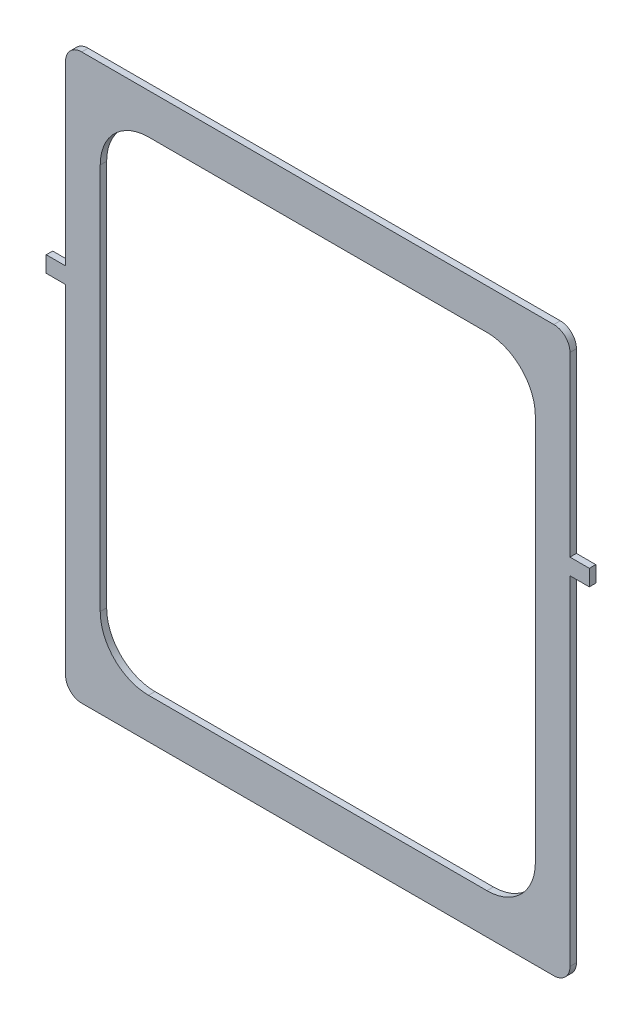
ISO-10303-21;
HEADER;
FILE_DESCRIPTION(('STEP AP214'),'2;1');
FILE_NAME('part.step','',(''),(''),'','','');
FILE_SCHEMA(('AUTOMOTIVE_DESIGN { 1 0 10303 214 1 1 1 1 }'));
ENDSEC;
DATA;
#1=APPLICATION_CONTEXT('core data for automotive mechanical design processes');
#2=APPLICATION_PROTOCOL_DEFINITION('international standard','automotive_design',2000,#1);
#3=PRODUCT_CONTEXT('',#1,'mechanical');
#4=PRODUCT('Part','Part','',(#3));
#5=PRODUCT_RELATED_PRODUCT_CATEGORY('part','',(#4));
#6=PRODUCT_DEFINITION_FORMATION('','',#4);
#7=PRODUCT_DEFINITION_CONTEXT('part definition',#1,'design');
#8=PRODUCT_DEFINITION('design','',#6,#7);
#9=PRODUCT_DEFINITION_SHAPE('','',#8);
#10=(LENGTH_UNIT() NAMED_UNIT(*) SI_UNIT(.MILLI.,.METRE.));
#11=(NAMED_UNIT(*) PLANE_ANGLE_UNIT() SI_UNIT($,.RADIAN.));
#12=(NAMED_UNIT(*) SI_UNIT($,.STERADIAN.) SOLID_ANGLE_UNIT());
#13=UNCERTAINTY_MEASURE_WITH_UNIT(LENGTH_MEASURE(1.E-05),#10,'distance_accuracy_value','');
#14=(GEOMETRIC_REPRESENTATION_CONTEXT(3) GLOBAL_UNCERTAINTY_ASSIGNED_CONTEXT((#13)) GLOBAL_UNIT_ASSIGNED_CONTEXT((#10,
#11,#12)) REPRESENTATION_CONTEXT('',''));
#15=CARTESIAN_POINT('',(0.,0.,0.));
#16=DIRECTION('',(0.,0.,1.));
#17=DIRECTION('',(1.,0.,0.));
#18=AXIS2_PLACEMENT_3D('',#15,#16,#17);
#19=CARTESIAN_POINT('',(-168.5,55.,0.));
#20=DIRECTION('',(-1.,0.,0.));
#21=DIRECTION('',(0.,-1.,0.));
#22=AXIS2_PLACEMENT_3D('',#19,#20,#21);
#23=PLANE('',#22);
#24=DIRECTION('',(0.,0.,1.));
#25=VECTOR('',#24,1.);
#26=CARTESIAN_POINT('',(-168.5,55.,0.));
#27=LINE('',#26,#25);
#28=CARTESIAN_POINT('',(-168.5,55.,-4.));
#29=VERTEX_POINT('',#28);
#30=CARTESIAN_POINT('',(-168.5,55.,0.));
#31=VERTEX_POINT('',#30);
#32=EDGE_CURVE('E12',#29,#31,#27,.T.);
#33=ORIENTED_EDGE('',*,*,#32,.F.);
#34=DIRECTION('',(0.,1.,0.));
#35=VECTOR('',#34,1.);
#36=CARTESIAN_POINT('',(-168.5,0.,-4.));
#37=LINE('',#36,#35);
#38=CARTESIAN_POINT('',(-168.5,45.,-4.));
#39=VERTEX_POINT('',#38);
#40=EDGE_CURVE('E163',#29,#39,#37,.F.);
#41=ORIENTED_EDGE('',*,*,#40,.T.);
#42=DIRECTION('',(0.,0.,1.));
#43=VECTOR('',#42,1.);
#44=CARTESIAN_POINT('',(-168.5,45.,0.));
#45=LINE('',#44,#43);
#46=CARTESIAN_POINT('',(-168.5,45.,0.));
#47=VERTEX_POINT('',#46);
#48=EDGE_CURVE('E56',#39,#47,#45,.T.);
#49=ORIENTED_EDGE('',*,*,#48,.T.);
#50=DIRECTION('',(0.,-1.,0.));
#51=VECTOR('',#50,1.);
#52=CARTESIAN_POINT('',(-168.5,55.,0.));
#53=LINE('',#52,#51);
#54=EDGE_CURVE('E333',#31,#47,#53,.T.);
#55=ORIENTED_EDGE('',*,*,#54,.F.);
#56=EDGE_LOOP('',(#33,#41,#49,#55));
#57=FACE_BOUND('',#56,.T.);
#58=ADVANCED_FACE('F45',(#57),#23,.T.);
#59=CARTESIAN_POINT('',(-168.5,45.,0.));
#60=DIRECTION('',(0.,-1.,0.));
#61=DIRECTION('',(1.,0.,0.));
#62=AXIS2_PLACEMENT_3D('',#59,#60,#61);
#63=PLANE('',#62);
#64=ORIENTED_EDGE('',*,*,#48,.F.);
#65=DIRECTION('',(1.,0.,0.));
#66=VECTOR('',#65,1.);
#67=CARTESIAN_POINT('',(0.,45.,-4.));
#68=LINE('',#67,#66);
#69=CARTESIAN_POINT('',(-156.5,45.,-4.));
#70=VERTEX_POINT('',#69);
#71=EDGE_CURVE('E239',#39,#70,#68,.T.);
#72=ORIENTED_EDGE('',*,*,#71,.T.);
#73=DIRECTION('',(0.,0.,1.));
#74=VECTOR('',#73,1.);
#75=CARTESIAN_POINT('',(-156.5,45.,0.));
#76=LINE('',#75,#74);
#77=CARTESIAN_POINT('',(-156.5,45.,0.));
#78=VERTEX_POINT('',#77);
#79=EDGE_CURVE('E323',#70,#78,#76,.T.);
#80=ORIENTED_EDGE('',*,*,#79,.T.);
#81=DIRECTION('',(1.,0.,0.));
#82=VECTOR('',#81,1.);
#83=CARTESIAN_POINT('',(-168.5,45.,0.));
#84=LINE('',#83,#82);
#85=EDGE_CURVE('E342',#47,#78,#84,.T.);
#86=ORIENTED_EDGE('',*,*,#85,.F.);
#87=EDGE_LOOP('',(#64,#72,#80,#86));
#88=FACE_BOUND('',#87,.T.);
#89=ADVANCED_FACE('F346',(#88),#63,.T.);
#90=CARTESIAN_POINT('',(-156.5,-175.,0.));
#91=DIRECTION('',(-1.,0.,0.));
#92=DIRECTION('',(0.,-1.,0.));
#93=AXIS2_PLACEMENT_3D('',#90,#91,#92);
#94=PLANE('',#93);
#95=ORIENTED_EDGE('',*,*,#79,.F.);
#96=DIRECTION('',(0.,1.,0.));
#97=VECTOR('',#96,1.);
#98=CARTESIAN_POINT('',(-156.5,0.,-4.));
#99=LINE('',#98,#97);
#100=CARTESIAN_POINT('',(-156.5,-165.,-4.));
#101=VERTEX_POINT('',#100);
#102=EDGE_CURVE('E236',#70,#101,#99,.F.);
#103=ORIENTED_EDGE('',*,*,#102,.T.);
#104=DIRECTION('',(0.,0.,1.));
#105=VECTOR('',#104,1.);
#106=CARTESIAN_POINT('',(-156.5,-165.,0.));
#107=LINE('',#106,#105);
#108=CARTESIAN_POINT('',(-156.5,-165.,0.));
#109=VERTEX_POINT('',#108);
#110=EDGE_CURVE('E319',#101,#109,#107,.T.);
#111=ORIENTED_EDGE('',*,*,#110,.T.);
#112=DIRECTION('',(0.,-1.,0.));
#113=VECTOR('',#112,1.);
#114=CARTESIAN_POINT('',(-156.5,-175.,0.));
#115=LINE('',#114,#113);
#116=EDGE_CURVE('E348',#78,#109,#115,.T.);
#117=ORIENTED_EDGE('',*,*,#116,.F.);
#118=EDGE_LOOP('',(#95,#103,#111,#117));
#119=FACE_BOUND('',#118,.T.);
#120=ADVANCED_FACE('F573',(#119),#94,.T.);
#121=CARTESIAN_POINT('',(-146.5,-165.,0.));
#122=DIRECTION('',(0.,0.,1.));
#123=DIRECTION('',(1.,0.,0.));
#124=AXIS2_PLACEMENT_3D('',#121,#122,#123);
#125=CYLINDRICAL_SURFACE('',#124,10.);
#126=ORIENTED_EDGE('',*,*,#110,.F.);
#127=CARTESIAN_POINT('',(-146.5,-165.,-4.));
#128=DIRECTION('',(0.,0.,1.));
#129=DIRECTION('',(1.,0.,0.));
#130=AXIS2_PLACEMENT_3D('',#127,#128,#129);
#131=CIRCLE('',#130,10.);
#132=CARTESIAN_POINT('',(-146.5,-175.,-4.));
#133=VERTEX_POINT('',#132);
#134=EDGE_CURVE('E231',#101,#133,#131,.T.);
#135=ORIENTED_EDGE('',*,*,#134,.T.);
#136=DIRECTION('',(0.,0.,1.));
#137=VECTOR('',#136,1.);
#138=CARTESIAN_POINT('',(-146.5,-175.,0.));
#139=LINE('',#138,#137);
#140=CARTESIAN_POINT('',(-146.5,-175.,0.));
#141=VERTEX_POINT('',#140);
#142=EDGE_CURVE('E315',#133,#141,#139,.T.);
#143=ORIENTED_EDGE('',*,*,#142,.T.);
#144=CARTESIAN_POINT('',(-146.5,-165.,0.));
#145=DIRECTION('',(0.,0.,1.));
#146=DIRECTION('',(1.,0.,0.));
#147=AXIS2_PLACEMENT_3D('',#144,#145,#146);
#148=CIRCLE('',#147,10.);
#149=EDGE_CURVE('E352',#109,#141,#148,.T.);
#150=ORIENTED_EDGE('',*,*,#149,.F.);
#151=EDGE_LOOP('',(#126,#135,#143,#150));
#152=FACE_BOUND('',#151,.T.);
#153=ADVANCED_FACE('F571',(#152),#125,.T.);
#154=CARTESIAN_POINT('',(156.5,-175.,0.));
#155=DIRECTION('',(0.,-1.,0.));
#156=DIRECTION('',(1.,0.,0.));
#157=AXIS2_PLACEMENT_3D('',#154,#155,#156);
#158=PLANE('',#157);
#159=ORIENTED_EDGE('',*,*,#142,.F.);
#160=DIRECTION('',(1.,0.,0.));
#161=VECTOR('',#160,1.);
#162=CARTESIAN_POINT('',(0.,-175.,-4.));
#163=LINE('',#162,#161);
#164=CARTESIAN_POINT('',(146.5,-175.,-4.));
#165=VERTEX_POINT('',#164);
#166=EDGE_CURVE('E226',#133,#165,#163,.T.);
#167=ORIENTED_EDGE('',*,*,#166,.T.);
#168=DIRECTION('',(0.,0.,1.));
#169=VECTOR('',#168,1.);
#170=CARTESIAN_POINT('',(146.5,-175.,0.));
#171=LINE('',#170,#169);
#172=CARTESIAN_POINT('',(146.5,-175.,0.));
#173=VERTEX_POINT('',#172);
#174=EDGE_CURVE('E311',#165,#173,#171,.T.);
#175=ORIENTED_EDGE('',*,*,#174,.T.);
#176=DIRECTION('',(1.,0.,0.));
#177=VECTOR('',#176,1.);
#178=CARTESIAN_POINT('',(156.5,-175.,0.));
#179=LINE('',#178,#177);
#180=EDGE_CURVE('E360',#141,#173,#179,.T.);
#181=ORIENTED_EDGE('',*,*,#180,.F.);
#182=EDGE_LOOP('',(#159,#167,#175,#181));
#183=FACE_BOUND('',#182,.T.);
#184=ADVANCED_FACE('F566',(#183),#158,.T.);
#185=CARTESIAN_POINT('',(146.5,-165.,0.));
#186=DIRECTION('',(0.,0.,1.));
#187=DIRECTION('',(1.,0.,0.));
#188=AXIS2_PLACEMENT_3D('',#185,#186,#187);
#189=CYLINDRICAL_SURFACE('',#188,10.);
#190=ORIENTED_EDGE('',*,*,#174,.F.);
#191=CARTESIAN_POINT('',(146.5,-165.,-4.));
#192=DIRECTION('',(0.,0.,1.));
#193=DIRECTION('',(1.,0.,0.));
#194=AXIS2_PLACEMENT_3D('',#191,#192,#193);
#195=CIRCLE('',#194,10.);
#196=CARTESIAN_POINT('',(156.5,-165.,-4.));
#197=VERTEX_POINT('',#196);
#198=EDGE_CURVE('E221',#165,#197,#195,.T.);
#199=ORIENTED_EDGE('',*,*,#198,.T.);
#200=DIRECTION('',(0.,0.,1.));
#201=VECTOR('',#200,1.);
#202=CARTESIAN_POINT('',(156.5,-165.,0.));
#203=LINE('',#202,#201);
#204=CARTESIAN_POINT('',(156.5,-165.,0.));
#205=VERTEX_POINT('',#204);
#206=EDGE_CURVE('E307',#197,#205,#203,.T.);
#207=ORIENTED_EDGE('',*,*,#206,.T.);
#208=CARTESIAN_POINT('',(146.5,-165.,0.));
#209=DIRECTION('',(0.,0.,1.));
#210=DIRECTION('',(1.,0.,0.));
#211=AXIS2_PLACEMENT_3D('',#208,#209,#210);
#212=CIRCLE('',#211,10.);
#213=EDGE_CURVE('E364',#173,#205,#212,.T.);
#214=ORIENTED_EDGE('',*,*,#213,.F.);
#215=EDGE_LOOP('',(#190,#199,#207,#214));
#216=FACE_BOUND('',#215,.T.);
#217=ADVANCED_FACE('F561',(#216),#189,.T.);
#218=CARTESIAN_POINT('',(156.5,-175.,0.));
#219=DIRECTION('',(1.,0.,0.));
#220=DIRECTION('',(0.,1.,0.));
#221=AXIS2_PLACEMENT_3D('',#218,#219,#220);
#222=PLANE('',#221);
#223=ORIENTED_EDGE('',*,*,#206,.F.);
#224=DIRECTION('',(0.,1.,0.));
#225=VECTOR('',#224,1.);
#226=CARTESIAN_POINT('',(156.5,0.,-4.));
#227=LINE('',#226,#225);
#228=CARTESIAN_POINT('',(156.5,45.,-4.));
#229=VERTEX_POINT('',#228);
#230=EDGE_CURVE('E216',#197,#229,#227,.T.);
#231=ORIENTED_EDGE('',*,*,#230,.T.);
#232=DIRECTION('',(0.,0.,1.));
#233=VECTOR('',#232,1.);
#234=CARTESIAN_POINT('',(156.5,45.,0.));
#235=LINE('',#234,#233);
#236=CARTESIAN_POINT('',(156.5,45.,0.));
#237=VERTEX_POINT('',#236);
#238=EDGE_CURVE('E303',#229,#237,#235,.T.);
#239=ORIENTED_EDGE('',*,*,#238,.T.);
#240=DIRECTION('',(0.,1.,0.));
#241=VECTOR('',#240,1.);
#242=CARTESIAN_POINT('',(156.5,-175.,0.));
#243=LINE('',#242,#241);
#244=EDGE_CURVE('E368',#205,#237,#243,.T.);
#245=ORIENTED_EDGE('',*,*,#244,.F.);
#246=EDGE_LOOP('',(#223,#231,#239,#245));
#247=FACE_BOUND('',#246,.T.);
#248=ADVANCED_FACE('F557',(#247),#222,.T.);
#249=CARTESIAN_POINT('',(168.5,45.,0.));
#250=DIRECTION('',(0.,1.,0.));
#251=DIRECTION('',(-1.,0.,0.));
#252=AXIS2_PLACEMENT_3D('',#249,#250,#251);
#253=PLANE('',#252);
#254=ORIENTED_EDGE('',*,*,#238,.F.);
#255=DIRECTION('',(1.,0.,0.));
#256=VECTOR('',#255,1.);
#257=CARTESIAN_POINT('',(0.,45.,-4.));
#258=LINE('',#257,#256);
#259=CARTESIAN_POINT('',(168.5,45.,-4.));
#260=VERTEX_POINT('',#259);
#261=EDGE_CURVE('E220',#260,#229,#258,.F.);
#262=ORIENTED_EDGE('',*,*,#261,.F.);
#263=DIRECTION('',(0.,0.,1.));
#264=VECTOR('',#263,1.);
#265=CARTESIAN_POINT('',(168.5,45.,0.));
#266=LINE('',#265,#264);
#267=CARTESIAN_POINT('',(168.5,45.,0.));
#268=VERTEX_POINT('',#267);
#269=EDGE_CURVE('E299',#260,#268,#266,.T.);
#270=ORIENTED_EDGE('',*,*,#269,.T.);
#271=DIRECTION('',(-1.,0.,0.));
#272=VECTOR('',#271,1.);
#273=CARTESIAN_POINT('',(168.5,45.,0.));
#274=LINE('',#273,#272);
#275=EDGE_CURVE('E372',#268,#237,#274,.T.);
#276=ORIENTED_EDGE('',*,*,#275,.T.);
#277=EDGE_LOOP('',(#254,#262,#270,#276));
#278=FACE_BOUND('',#277,.T.);
#279=ADVANCED_FACE('F594',(#278),#253,.F.);
#280=CARTESIAN_POINT('',(168.5,55.,0.));
#281=DIRECTION('',(-1.,0.,0.));
#282=DIRECTION('',(0.,-1.,0.));
#283=AXIS2_PLACEMENT_3D('',#280,#281,#282);
#284=PLANE('',#283);
#285=ORIENTED_EDGE('',*,*,#269,.F.);
#286=DIRECTION('',(0.,1.,0.));
#287=VECTOR('',#286,1.);
#288=CARTESIAN_POINT('',(168.5,0.,-4.));
#289=LINE('',#288,#287);
#290=CARTESIAN_POINT('',(168.5,55.,-4.));
#291=VERTEX_POINT('',#290);
#292=EDGE_CURVE('E209',#291,#260,#289,.F.);
#293=ORIENTED_EDGE('',*,*,#292,.F.);
#294=DIRECTION('',(0.,0.,1.));
#295=VECTOR('',#294,1.);
#296=CARTESIAN_POINT('',(168.5,55.,0.));
#297=LINE('',#296,#295);
#298=CARTESIAN_POINT('',(168.5,55.,0.));
#299=VERTEX_POINT('',#298);
#300=EDGE_CURVE('E295',#291,#299,#297,.T.);
#301=ORIENTED_EDGE('',*,*,#300,.T.);
#302=DIRECTION('',(0.,-1.,0.));
#303=VECTOR('',#302,1.);
#304=CARTESIAN_POINT('',(168.5,55.,0.));
#305=LINE('',#304,#303);
#306=EDGE_CURVE('E377',#299,#268,#305,.T.);
#307=ORIENTED_EDGE('',*,*,#306,.T.);
#308=EDGE_LOOP('',(#285,#293,#301,#307));
#309=FACE_BOUND('',#308,.T.);
#310=ADVANCED_FACE('F597',(#309),#284,.F.);
#311=CARTESIAN_POINT('',(156.5,55.,0.));
#312=DIRECTION('',(0.,-1.,0.));
#313=DIRECTION('',(1.,0.,0.));
#314=AXIS2_PLACEMENT_3D('',#311,#312,#313);
#315=PLANE('',#314);
#316=ORIENTED_EDGE('',*,*,#300,.F.);
#317=DIRECTION('',(1.,0.,0.));
#318=VECTOR('',#317,1.);
#319=CARTESIAN_POINT('',(0.,55.,-4.));
#320=LINE('',#319,#318);
#321=CARTESIAN_POINT('',(156.5,55.,-4.));
#322=VERTEX_POINT('',#321);
#323=EDGE_CURVE('E204',#322,#291,#320,.T.);
#324=ORIENTED_EDGE('',*,*,#323,.F.);
#325=DIRECTION('',(0.,0.,1.));
#326=VECTOR('',#325,1.);
#327=CARTESIAN_POINT('',(156.5,55.,0.));
#328=LINE('',#327,#326);
#329=CARTESIAN_POINT('',(156.5,55.,0.));
#330=VERTEX_POINT('',#329);
#331=EDGE_CURVE('E291',#322,#330,#328,.T.);
#332=ORIENTED_EDGE('',*,*,#331,.T.);
#333=DIRECTION('',(1.,0.,0.));
#334=VECTOR('',#333,1.);
#335=CARTESIAN_POINT('',(156.5,55.,0.));
#336=LINE('',#335,#334);
#337=EDGE_CURVE('E381',#330,#299,#336,.T.);
#338=ORIENTED_EDGE('',*,*,#337,.T.);
#339=EDGE_LOOP('',(#316,#324,#332,#338));
#340=FACE_BOUND('',#339,.T.);
#341=ADVANCED_FACE('F600',(#340),#315,.F.);
#342=ORIENTED_EDGE('',*,*,#331,.F.);
#343=DIRECTION('',(0.,1.,0.));
#344=VECTOR('',#343,1.);
#345=CARTESIAN_POINT('',(156.5,0.,-4.));
#346=LINE('',#345,#344);
#347=CARTESIAN_POINT('',(156.5,165.,-4.));
#348=VERTEX_POINT('',#347);
#349=EDGE_CURVE('E199',#322,#348,#346,.T.);
#350=ORIENTED_EDGE('',*,*,#349,.T.);
#351=DIRECTION('',(0.,0.,1.));
#352=VECTOR('',#351,1.);
#353=CARTESIAN_POINT('',(156.5,165.,0.));
#354=LINE('',#353,#352);
#355=CARTESIAN_POINT('',(156.5,165.,0.));
#356=VERTEX_POINT('',#355);
#357=EDGE_CURVE('E287',#348,#356,#354,.T.);
#358=ORIENTED_EDGE('',*,*,#357,.T.);
#359=EDGE_CURVE('E373',#330,#356,#243,.T.);
#360=ORIENTED_EDGE('',*,*,#359,.F.);
#361=EDGE_LOOP('',(#342,#350,#358,#360));
#362=FACE_BOUND('',#361,.T.);
#363=ADVANCED_FACE('F604',(#362),#222,.T.);
#364=CARTESIAN_POINT('',(146.5,165.,0.));
#365=DIRECTION('',(0.,0.,1.));
#366=DIRECTION('',(1.,0.,0.));
#367=AXIS2_PLACEMENT_3D('',#364,#365,#366);
#368=CYLINDRICAL_SURFACE('',#367,10.);
#369=ORIENTED_EDGE('',*,*,#357,.F.);
#370=CARTESIAN_POINT('',(146.5,165.,-4.));
#371=DIRECTION('',(0.,0.,1.));
#372=DIRECTION('',(1.,0.,0.));
#373=AXIS2_PLACEMENT_3D('',#370,#371,#372);
#374=CIRCLE('',#373,10.);
#375=CARTESIAN_POINT('',(146.5,175.,-4.));
#376=VERTEX_POINT('',#375);
#377=EDGE_CURVE('E195',#348,#376,#374,.T.);
#378=ORIENTED_EDGE('',*,*,#377,.T.);
#379=DIRECTION('',(0.,0.,1.));
#380=VECTOR('',#379,1.);
#381=CARTESIAN_POINT('',(146.5,175.,0.));
#382=LINE('',#381,#380);
#383=CARTESIAN_POINT('',(146.5,175.,0.));
#384=VERTEX_POINT('',#383);
#385=EDGE_CURVE('E283',#376,#384,#382,.T.);
#386=ORIENTED_EDGE('',*,*,#385,.T.);
#387=CARTESIAN_POINT('',(146.5,165.,0.));
#388=DIRECTION('',(0.,0.,1.));
#389=DIRECTION('',(1.,0.,0.));
#390=AXIS2_PLACEMENT_3D('',#387,#388,#389);
#391=CIRCLE('',#390,10.);
#392=EDGE_CURVE('E385',#356,#384,#391,.T.);
#393=ORIENTED_EDGE('',*,*,#392,.F.);
#394=EDGE_LOOP('',(#369,#378,#386,#393));
#395=FACE_BOUND('',#394,.T.);
#396=ADVANCED_FACE('F473',(#395),#368,.T.);
#397=CARTESIAN_POINT('',(156.5,175.,0.));
#398=DIRECTION('',(0.,1.,0.));
#399=DIRECTION('',(-1.,0.,0.));
#400=AXIS2_PLACEMENT_3D('',#397,#398,#399);
#401=PLANE('',#400);
#402=ORIENTED_EDGE('',*,*,#385,.F.);
#403=DIRECTION('',(1.,0.,0.));
#404=VECTOR('',#403,1.);
#405=CARTESIAN_POINT('',(0.,175.,-4.));
#406=LINE('',#405,#404);
#407=CARTESIAN_POINT('',(-146.5,175.,-4.));
#408=VERTEX_POINT('',#407);
#409=EDGE_CURVE('E185',#376,#408,#406,.F.);
#410=ORIENTED_EDGE('',*,*,#409,.T.);
#411=DIRECTION('',(0.,0.,1.));
#412=VECTOR('',#411,1.);
#413=CARTESIAN_POINT('',(-146.5,175.,0.));
#414=LINE('',#413,#412);
#415=CARTESIAN_POINT('',(-146.5,175.,0.));
#416=VERTEX_POINT('',#415);
#417=EDGE_CURVE('E280',#408,#416,#414,.T.);
#418=ORIENTED_EDGE('',*,*,#417,.T.);
#419=DIRECTION('',(-1.,0.,0.));
#420=VECTOR('',#419,1.);
#421=CARTESIAN_POINT('',(156.5,175.,0.));
#422=LINE('',#421,#420);
#423=EDGE_CURVE('E389',#384,#416,#422,.T.);
#424=ORIENTED_EDGE('',*,*,#423,.F.);
#425=EDGE_LOOP('',(#402,#410,#418,#424));
#426=FACE_BOUND('',#425,.T.);
#427=ADVANCED_FACE('F482',(#426),#401,.T.);
#428=CARTESIAN_POINT('',(-146.5,165.,0.));
#429=DIRECTION('',(0.,0.,1.));
#430=DIRECTION('',(1.,0.,0.));
#431=AXIS2_PLACEMENT_3D('',#428,#429,#430);
#432=CYLINDRICAL_SURFACE('',#431,10.);
#433=ORIENTED_EDGE('',*,*,#417,.F.);
#434=CARTESIAN_POINT('',(-146.5,165.,-4.));
#435=DIRECTION('',(0.,0.,1.));
#436=DIRECTION('',(1.,0.,0.));
#437=AXIS2_PLACEMENT_3D('',#434,#435,#436);
#438=CIRCLE('',#437,10.);
#439=CARTESIAN_POINT('',(-156.5,165.,-4.));
#440=VERTEX_POINT('',#439);
#441=EDGE_CURVE('E180',#408,#440,#438,.T.);
#442=ORIENTED_EDGE('',*,*,#441,.T.);
#443=DIRECTION('',(0.,0.,1.));
#444=VECTOR('',#443,1.);
#445=CARTESIAN_POINT('',(-156.5,165.,0.));
#446=LINE('',#445,#444);
#447=CARTESIAN_POINT('',(-156.5,165.,0.));
#448=VERTEX_POINT('',#447);
#449=EDGE_CURVE('E64',#440,#448,#446,.T.);
#450=ORIENTED_EDGE('',*,*,#449,.T.);
#451=CARTESIAN_POINT('',(-146.5,165.,0.));
#452=DIRECTION('',(0.,0.,1.));
#453=DIRECTION('',(1.,0.,0.));
#454=AXIS2_PLACEMENT_3D('',#451,#452,#453);
#455=CIRCLE('',#454,10.);
#456=EDGE_CURVE('E277',#416,#448,#455,.T.);
#457=ORIENTED_EDGE('',*,*,#456,.F.);
#458=EDGE_LOOP('',(#433,#442,#450,#457));
#459=FACE_BOUND('',#458,.T.);
#460=ADVANCED_FACE('F483',(#459),#432,.T.);
#461=ORIENTED_EDGE('',*,*,#449,.F.);
#462=DIRECTION('',(0.,1.,0.));
#463=VECTOR('',#462,1.);
#464=CARTESIAN_POINT('',(-156.5,0.,-4.));
#465=LINE('',#464,#463);
#466=CARTESIAN_POINT('',(-156.5,55.,-4.));
#467=VERTEX_POINT('',#466);
#468=EDGE_CURVE('E161',#440,#467,#465,.F.);
#469=ORIENTED_EDGE('',*,*,#468,.T.);
#470=DIRECTION('',(0.,0.,1.));
#471=VECTOR('',#470,1.);
#472=CARTESIAN_POINT('',(-156.5,55.,0.));
#473=LINE('',#472,#471);
#474=CARTESIAN_POINT('',(-156.5,55.,0.));
#475=VERTEX_POINT('',#474);
#476=EDGE_CURVE('E49',#467,#475,#473,.T.);
#477=ORIENTED_EDGE('',*,*,#476,.T.);
#478=EDGE_CURVE('E354',#448,#475,#115,.T.);
#479=ORIENTED_EDGE('',*,*,#478,.F.);
#480=EDGE_LOOP('',(#461,#469,#477,#479));
#481=FACE_BOUND('',#480,.T.);
#482=ADVANCED_FACE('F166',(#481),#94,.T.);
#483=CARTESIAN_POINT('',(135.,150.,0.));
#484=DIRECTION('',(0.,1.,0.));
#485=DIRECTION('',(-1.,0.,0.));
#486=AXIS2_PLACEMENT_3D('',#483,#484,#485);
#487=PLANE('',#486);
#488=DIRECTION('',(0.,0.,1.));
#489=VECTOR('',#488,1.);
#490=CARTESIAN_POINT('',(-105.,150.,0.));
#491=LINE('',#490,#489);
#492=CARTESIAN_POINT('',(-105.,150.,-4.));
#493=VERTEX_POINT('',#492);
#494=CARTESIAN_POINT('',(-105.,150.,0.));
#495=VERTEX_POINT('',#494);
#496=EDGE_CURVE('E156',#493,#495,#491,.T.);
#497=ORIENTED_EDGE('',*,*,#496,.F.);
#498=DIRECTION('',(1.,0.,0.));
#499=VECTOR('',#498,1.);
#500=CARTESIAN_POINT('',(0.,150.,-4.));
#501=LINE('',#500,#499);
#502=CARTESIAN_POINT('',(105.,150.,-4.));
#503=VERTEX_POINT('',#502);
#504=EDGE_CURVE('E415',#503,#493,#501,.F.);
#505=ORIENTED_EDGE('',*,*,#504,.F.);
#506=DIRECTION('',(0.,0.,1.));
#507=VECTOR('',#506,1.);
#508=CARTESIAN_POINT('',(105.,150.,0.));
#509=LINE('',#508,#507);
#510=CARTESIAN_POINT('',(105.,150.,0.));
#511=VERTEX_POINT('',#510);
#512=EDGE_CURVE('E267',#503,#511,#509,.T.);
#513=ORIENTED_EDGE('',*,*,#512,.T.);
#514=DIRECTION('',(-1.,0.,0.));
#515=VECTOR('',#514,1.);
#516=CARTESIAN_POINT('',(135.,150.,0.));
#517=LINE('',#516,#515);
#518=EDGE_CURVE('E506',#511,#495,#517,.T.);
#519=ORIENTED_EDGE('',*,*,#518,.T.);
#520=EDGE_LOOP('',(#497,#505,#513,#519));
#521=FACE_BOUND('',#520,.T.);
#522=ADVANCED_FACE('F585',(#521),#487,.F.);
#523=CARTESIAN_POINT('',(105.,120.,0.));
#524=DIRECTION('',(0.,0.,1.));
#525=DIRECTION('',(1.,0.,0.));
#526=AXIS2_PLACEMENT_3D('',#523,#524,#525);
#527=CYLINDRICAL_SURFACE('',#526,30.);
#528=ORIENTED_EDGE('',*,*,#512,.F.);
#529=CARTESIAN_POINT('',(105.,120.,-4.));
#530=DIRECTION('',(0.,0.,1.));
#531=DIRECTION('',(1.,0.,0.));
#532=AXIS2_PLACEMENT_3D('',#529,#530,#531);
#533=CIRCLE('',#532,30.);
#534=CARTESIAN_POINT('',(135.,120.,-4.));
#535=VERTEX_POINT('',#534);
#536=EDGE_CURVE('E412',#503,#535,#533,.F.);
#537=ORIENTED_EDGE('',*,*,#536,.T.);
#538=DIRECTION('',(0.,0.,1.));
#539=VECTOR('',#538,1.);
#540=CARTESIAN_POINT('',(135.,120.,0.));
#541=LINE('',#540,#539);
#542=CARTESIAN_POINT('',(135.,120.,0.));
#543=VERTEX_POINT('',#542);
#544=EDGE_CURVE('E263',#535,#543,#541,.T.);
#545=ORIENTED_EDGE('',*,*,#544,.T.);
#546=CARTESIAN_POINT('',(105.,120.,0.));
#547=DIRECTION('',(0.,0.,1.));
#548=DIRECTION('',(1.,0.,0.));
#549=AXIS2_PLACEMENT_3D('',#546,#547,#548);
#550=CIRCLE('',#549,30.);
#551=EDGE_CURVE('E502',#511,#543,#550,.F.);
#552=ORIENTED_EDGE('',*,*,#551,.F.);
#553=EDGE_LOOP('',(#528,#537,#545,#552));
#554=FACE_BOUND('',#553,.T.);
#555=ADVANCED_FACE('F627',(#554),#527,.F.);
#556=CARTESIAN_POINT('',(135.,-150.,0.));
#557=DIRECTION('',(1.,0.,0.));
#558=DIRECTION('',(0.,1.,0.));
#559=AXIS2_PLACEMENT_3D('',#556,#557,#558);
#560=PLANE('',#559);
#561=ORIENTED_EDGE('',*,*,#544,.F.);
#562=DIRECTION('',(0.,1.,0.));
#563=VECTOR('',#562,1.);
#564=CARTESIAN_POINT('',(135.,0.,-4.));
#565=LINE('',#564,#563);
#566=CARTESIAN_POINT('',(135.,-120.,-4.));
#567=VERTEX_POINT('',#566);
#568=EDGE_CURVE('E407',#567,#535,#565,.T.);
#569=ORIENTED_EDGE('',*,*,#568,.F.);
#570=DIRECTION('',(0.,0.,1.));
#571=VECTOR('',#570,1.);
#572=CARTESIAN_POINT('',(135.,-120.,0.));
#573=LINE('',#572,#571);
#574=CARTESIAN_POINT('',(135.,-120.,0.));
#575=VERTEX_POINT('',#574);
#576=EDGE_CURVE('E259',#567,#575,#573,.T.);
#577=ORIENTED_EDGE('',*,*,#576,.T.);
#578=DIRECTION('',(0.,1.,0.));
#579=VECTOR('',#578,1.);
#580=CARTESIAN_POINT('',(135.,-150.,0.));
#581=LINE('',#580,#579);
#582=EDGE_CURVE('E498',#575,#543,#581,.T.);
#583=ORIENTED_EDGE('',*,*,#582,.T.);
#584=EDGE_LOOP('',(#561,#569,#577,#583));
#585=FACE_BOUND('',#584,.T.);
#586=ADVANCED_FACE('F635',(#585),#560,.F.);
#587=CARTESIAN_POINT('',(105.,-120.,0.));
#588=DIRECTION('',(0.,0.,1.));
#589=DIRECTION('',(1.,0.,0.));
#590=AXIS2_PLACEMENT_3D('',#587,#588,#589);
#591=CYLINDRICAL_SURFACE('',#590,30.);
#592=ORIENTED_EDGE('',*,*,#576,.F.);
#593=CARTESIAN_POINT('',(105.,-120.,-4.));
#594=DIRECTION('',(0.,0.,1.));
#595=DIRECTION('',(1.,0.,0.));
#596=AXIS2_PLACEMENT_3D('',#593,#594,#595);
#597=CIRCLE('',#596,30.);
#598=CARTESIAN_POINT('',(105.,-150.,-4.));
#599=VERTEX_POINT('',#598);
#600=EDGE_CURVE('E404',#567,#599,#597,.F.);
#601=ORIENTED_EDGE('',*,*,#600,.T.);
#602=DIRECTION('',(0.,0.,1.));
#603=VECTOR('',#602,1.);
#604=CARTESIAN_POINT('',(105.,-150.,0.));
#605=LINE('',#604,#603);
#606=CARTESIAN_POINT('',(105.,-150.,0.));
#607=VERTEX_POINT('',#606);
#608=EDGE_CURVE('E255',#599,#607,#605,.T.);
#609=ORIENTED_EDGE('',*,*,#608,.T.);
#610=CARTESIAN_POINT('',(105.,-120.,0.));
#611=DIRECTION('',(0.,0.,1.));
#612=DIRECTION('',(1.,0.,0.));
#613=AXIS2_PLACEMENT_3D('',#610,#611,#612);
#614=CIRCLE('',#613,30.);
#615=EDGE_CURVE('E494',#575,#607,#614,.F.);
#616=ORIENTED_EDGE('',*,*,#615,.F.);
#617=EDGE_LOOP('',(#592,#601,#609,#616));
#618=FACE_BOUND('',#617,.T.);
#619=ADVANCED_FACE('F643',(#618),#591,.F.);
#620=CARTESIAN_POINT('',(135.,-150.,0.));
#621=DIRECTION('',(0.,-1.,0.));
#622=DIRECTION('',(1.,0.,0.));
#623=AXIS2_PLACEMENT_3D('',#620,#621,#622);
#624=PLANE('',#623);
#625=ORIENTED_EDGE('',*,*,#608,.F.);
#626=DIRECTION('',(1.,0.,0.));
#627=VECTOR('',#626,1.);
#628=CARTESIAN_POINT('',(0.,-150.,-4.));
#629=LINE('',#628,#627);
#630=CARTESIAN_POINT('',(-105.,-150.,-4.));
#631=VERTEX_POINT('',#630);
#632=EDGE_CURVE('E174',#631,#599,#629,.T.);
#633=ORIENTED_EDGE('',*,*,#632,.F.);
#634=DIRECTION('',(0.,0.,1.));
#635=VECTOR('',#634,1.);
#636=CARTESIAN_POINT('',(-105.,-150.,0.));
#637=LINE('',#636,#635);
#638=CARTESIAN_POINT('',(-105.,-150.,0.));
#639=VERTEX_POINT('',#638);
#640=EDGE_CURVE('E250',#631,#639,#637,.T.);
#641=ORIENTED_EDGE('',*,*,#640,.T.);
#642=DIRECTION('',(1.,0.,0.));
#643=VECTOR('',#642,1.);
#644=CARTESIAN_POINT('',(135.,-150.,0.));
#645=LINE('',#644,#643);
#646=EDGE_CURVE('E488',#639,#607,#645,.T.);
#647=ORIENTED_EDGE('',*,*,#646,.T.);
#648=EDGE_LOOP('',(#625,#633,#641,#647));
#649=FACE_BOUND('',#648,.T.);
#650=ADVANCED_FACE('F651',(#649),#624,.F.);
#651=CARTESIAN_POINT('',(-105.,-120.,0.));
#652=DIRECTION('',(0.,0.,1.));
#653=DIRECTION('',(1.,0.,0.));
#654=AXIS2_PLACEMENT_3D('',#651,#652,#653);
#655=CYLINDRICAL_SURFACE('',#654,30.);
#656=ORIENTED_EDGE('',*,*,#640,.F.);
#657=CARTESIAN_POINT('',(-105.,-120.,-4.));
#658=DIRECTION('',(0.,0.,1.));
#659=DIRECTION('',(1.,0.,0.));
#660=AXIS2_PLACEMENT_3D('',#657,#658,#659);
#661=CIRCLE('',#660,30.);
#662=CARTESIAN_POINT('',(-135.,-120.,-4.));
#663=VERTEX_POINT('',#662);
#664=EDGE_CURVE('E168',#631,#663,#661,.F.);
#665=ORIENTED_EDGE('',*,*,#664,.T.);
#666=DIRECTION('',(0.,0.,1.));
#667=VECTOR('',#666,1.);
#668=CARTESIAN_POINT('',(-135.,-120.,0.));
#669=LINE('',#668,#667);
#670=CARTESIAN_POINT('',(-135.,-120.,0.));
#671=VERTEX_POINT('',#670);
#672=EDGE_CURVE('E246',#663,#671,#669,.T.);
#673=ORIENTED_EDGE('',*,*,#672,.T.);
#674=CARTESIAN_POINT('',(-105.,-120.,0.));
#675=DIRECTION('',(0.,0.,1.));
#676=DIRECTION('',(1.,0.,0.));
#677=AXIS2_PLACEMENT_3D('',#674,#675,#676);
#678=CIRCLE('',#677,30.);
#679=EDGE_CURVE('E445',#639,#671,#678,.F.);
#680=ORIENTED_EDGE('',*,*,#679,.F.);
#681=EDGE_LOOP('',(#656,#665,#673,#680));
#682=FACE_BOUND('',#681,.T.);
#683=ADVANCED_FACE('F443',(#682),#655,.F.);
#684=CARTESIAN_POINT('',(-135.,-150.,0.));
#685=DIRECTION('',(-1.,0.,0.));
#686=DIRECTION('',(0.,-1.,0.));
#687=AXIS2_PLACEMENT_3D('',#684,#685,#686);
#688=PLANE('',#687);
#689=ORIENTED_EDGE('',*,*,#672,.F.);
#690=DIRECTION('',(0.,1.,0.));
#691=VECTOR('',#690,1.);
#692=CARTESIAN_POINT('',(-135.,0.,-4.));
#693=LINE('',#692,#691);
#694=CARTESIAN_POINT('',(-135.,120.,-4.));
#695=VERTEX_POINT('',#694);
#696=EDGE_CURVE('E396',#695,#663,#693,.F.);
#697=ORIENTED_EDGE('',*,*,#696,.F.);
#698=DIRECTION('',(0.,0.,1.));
#699=VECTOR('',#698,1.);
#700=CARTESIAN_POINT('',(-135.,120.,0.));
#701=LINE('',#700,#699);
#702=CARTESIAN_POINT('',(-135.,120.,0.));
#703=VERTEX_POINT('',#702);
#704=EDGE_CURVE('E251',#695,#703,#701,.T.);
#705=ORIENTED_EDGE('',*,*,#704,.T.);
#706=DIRECTION('',(0.,-1.,0.));
#707=VECTOR('',#706,1.);
#708=CARTESIAN_POINT('',(-135.,-150.,0.));
#709=LINE('',#708,#707);
#710=EDGE_CURVE('E184',#703,#671,#709,.T.);
#711=ORIENTED_EDGE('',*,*,#710,.T.);
#712=EDGE_LOOP('',(#689,#697,#705,#711));
#713=FACE_BOUND('',#712,.T.);
#714=ADVANCED_FACE('F436',(#713),#688,.F.);
#715=CARTESIAN_POINT('',(-105.,120.,0.));
#716=DIRECTION('',(0.,0.,1.));
#717=DIRECTION('',(1.,0.,0.));
#718=AXIS2_PLACEMENT_3D('',#715,#716,#717);
#719=CYLINDRICAL_SURFACE('',#718,30.);
#720=CARTESIAN_POINT('',(-105.,120.,-4.));
#721=DIRECTION('',(0.,0.,1.));
#722=DIRECTION('',(1.,0.,0.));
#723=AXIS2_PLACEMENT_3D('',#720,#721,#722);
#724=CIRCLE('',#723,30.);
#725=EDGE_CURVE('E178',#695,#493,#724,.F.);
#726=ORIENTED_EDGE('',*,*,#725,.T.);
#727=ORIENTED_EDGE('',*,*,#496,.T.);
#728=CARTESIAN_POINT('',(-105.,120.,0.));
#729=DIRECTION('',(0.,0.,1.));
#730=DIRECTION('',(1.,0.,0.));
#731=AXIS2_PLACEMENT_3D('',#728,#729,#730);
#732=CIRCLE('',#731,30.);
#733=EDGE_CURVE('E510',#703,#495,#732,.F.);
#734=ORIENTED_EDGE('',*,*,#733,.F.);
#735=ORIENTED_EDGE('',*,*,#704,.F.);
#736=EDGE_LOOP('',(#726,#727,#734,#735));
#737=FACE_BOUND('',#736,.T.);
#738=ADVANCED_FACE('F429',(#737),#719,.F.);
#739=CARTESIAN_POINT('',(-156.5,55.,0.));
#740=DIRECTION('',(0.,1.,0.));
#741=DIRECTION('',(-1.,0.,0.));
#742=AXIS2_PLACEMENT_3D('',#739,#740,#741);
#743=PLANE('',#742);
#744=DIRECTION('',(1.,0.,0.));
#745=VECTOR('',#744,1.);
#746=CARTESIAN_POINT('',(0.,55.,-4.));
#747=LINE('',#746,#745);
#748=EDGE_CURVE('E148',#467,#29,#747,.F.);
#749=ORIENTED_EDGE('',*,*,#748,.T.);
#750=ORIENTED_EDGE('',*,*,#32,.T.);
#751=DIRECTION('',(-1.,0.,0.));
#752=VECTOR('',#751,1.);
#753=CARTESIAN_POINT('',(-156.5,55.,0.));
#754=LINE('',#753,#752);
#755=EDGE_CURVE('E151',#475,#31,#754,.T.);
#756=ORIENTED_EDGE('',*,*,#755,.F.);
#757=ORIENTED_EDGE('',*,*,#476,.F.);
#758=EDGE_LOOP('',(#749,#750,#756,#757));
#759=FACE_BOUND('',#758,.T.);
#760=ADVANCED_FACE('F47',(#759),#743,.T.);
#761=CARTESIAN_POINT('',(0.,0.,0.));
#762=DIRECTION('',(0.,0.,1.));
#763=DIRECTION('',(1.,0.,0.));
#764=AXIS2_PLACEMENT_3D('',#761,#762,#763);
#765=PLANE('',#764);
#766=ORIENTED_EDGE('',*,*,#710,.F.);
#767=ORIENTED_EDGE('',*,*,#733,.T.);
#768=ORIENTED_EDGE('',*,*,#518,.F.);
#769=ORIENTED_EDGE('',*,*,#551,.T.);
#770=ORIENTED_EDGE('',*,*,#582,.F.);
#771=ORIENTED_EDGE('',*,*,#615,.T.);
#772=ORIENTED_EDGE('',*,*,#646,.F.);
#773=ORIENTED_EDGE('',*,*,#679,.T.);
#774=EDGE_LOOP('',(#766,#767,#768,#769,#770,#771,#772,#773));
#775=FACE_BOUND('',#774,.T.);
#776=ORIENTED_EDGE('',*,*,#478,.T.);
#777=ORIENTED_EDGE('',*,*,#755,.T.);
#778=ORIENTED_EDGE('',*,*,#54,.T.);
#779=ORIENTED_EDGE('',*,*,#85,.T.);
#780=ORIENTED_EDGE('',*,*,#116,.T.);
#781=ORIENTED_EDGE('',*,*,#149,.T.);
#782=ORIENTED_EDGE('',*,*,#180,.T.);
#783=ORIENTED_EDGE('',*,*,#213,.T.);
#784=ORIENTED_EDGE('',*,*,#244,.T.);
#785=ORIENTED_EDGE('',*,*,#275,.F.);
#786=ORIENTED_EDGE('',*,*,#306,.F.);
#787=ORIENTED_EDGE('',*,*,#337,.F.);
#788=ORIENTED_EDGE('',*,*,#359,.T.);
#789=ORIENTED_EDGE('',*,*,#392,.T.);
#790=ORIENTED_EDGE('',*,*,#423,.T.);
#791=ORIENTED_EDGE('',*,*,#456,.T.);
#792=EDGE_LOOP('',(#776,#777,#778,#779,#780,#781,#782,#783,#784,#785,#786,#787,#788,#789,#790,#791));
#793=FACE_BOUND('',#792,.T.);
#794=ADVANCED_FACE('F340',(#775,#793),#765,.T.);
#795=CARTESIAN_POINT('',(0.,0.,-4.));
#796=DIRECTION('',(0.,0.,1.));
#797=DIRECTION('',(1.,0.,0.));
#798=AXIS2_PLACEMENT_3D('',#795,#796,#797);
#799=PLANE('',#798);
#800=ORIENTED_EDGE('',*,*,#696,.T.);
#801=ORIENTED_EDGE('',*,*,#664,.F.);
#802=ORIENTED_EDGE('',*,*,#632,.T.);
#803=ORIENTED_EDGE('',*,*,#600,.F.);
#804=ORIENTED_EDGE('',*,*,#568,.T.);
#805=ORIENTED_EDGE('',*,*,#536,.F.);
#806=ORIENTED_EDGE('',*,*,#504,.T.);
#807=ORIENTED_EDGE('',*,*,#725,.F.);
#808=EDGE_LOOP('',(#800,#801,#802,#803,#804,#805,#806,#807));
#809=FACE_BOUND('',#808,.T.);
#810=ORIENTED_EDGE('',*,*,#468,.F.);
#811=ORIENTED_EDGE('',*,*,#441,.F.);
#812=ORIENTED_EDGE('',*,*,#409,.F.);
#813=ORIENTED_EDGE('',*,*,#377,.F.);
#814=ORIENTED_EDGE('',*,*,#349,.F.);
#815=ORIENTED_EDGE('',*,*,#323,.T.);
#816=ORIENTED_EDGE('',*,*,#292,.T.);
#817=ORIENTED_EDGE('',*,*,#261,.T.);
#818=ORIENTED_EDGE('',*,*,#230,.F.);
#819=ORIENTED_EDGE('',*,*,#198,.F.);
#820=ORIENTED_EDGE('',*,*,#166,.F.);
#821=ORIENTED_EDGE('',*,*,#134,.F.);
#822=ORIENTED_EDGE('',*,*,#102,.F.);
#823=ORIENTED_EDGE('',*,*,#71,.F.);
#824=ORIENTED_EDGE('',*,*,#40,.F.);
#825=ORIENTED_EDGE('',*,*,#748,.F.);
#826=EDGE_LOOP('',(#810,#811,#812,#813,#814,#815,#816,#817,#818,#819,#820,#821,#822,#823,#824,#825));
#827=FACE_BOUND('',#826,.T.);
#828=ADVANCED_FACE('F159',(#809,#827),#799,.F.);
#829=CLOSED_SHELL('',(#58,#89,#120,#153,#184,#217,#248,#279,#310,#341,#363,#396,#427,#460,#482,
#522,#555,#586,#619,#650,#683,#714,#738,#760,#794,#828));
#830=MANIFOLD_SOLID_BREP('B2',#829);
#831=ADVANCED_BREP_SHAPE_REPRESENTATION('',(#18,#830),#14);
#832=SHAPE_DEFINITION_REPRESENTATION(#9,#831);
ENDSEC;
END-ISO-10303-21;
